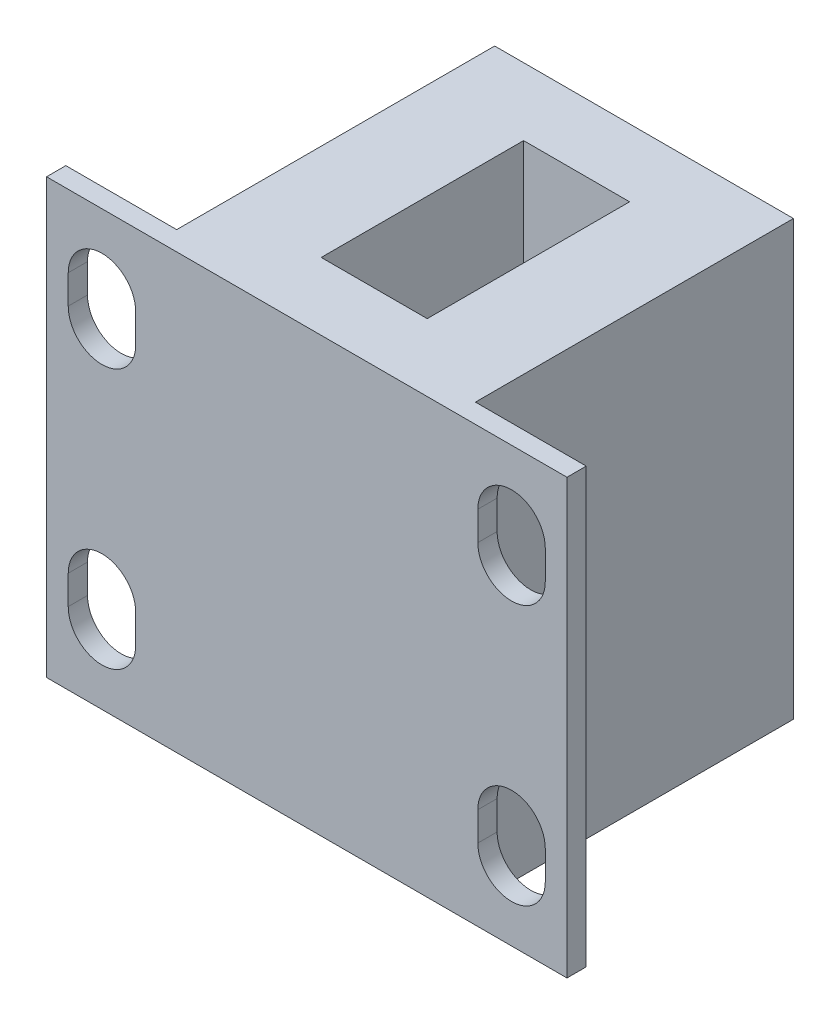
ISO-10303-21;
HEADER;
FILE_DESCRIPTION(('STEP AP214'),'2;1');
FILE_NAME('part.step','',(''),(''),'','','');
FILE_SCHEMA(('AUTOMOTIVE_DESIGN { 1 0 10303 214 1 1 1 1 }'));
ENDSEC;
DATA;
#1=APPLICATION_CONTEXT('core data for automotive mechanical design processes');
#2=APPLICATION_PROTOCOL_DEFINITION('international standard','automotive_design',2000,#1);
#3=PRODUCT_CONTEXT('',#1,'mechanical');
#4=PRODUCT('Part','Part','',(#3));
#5=PRODUCT_RELATED_PRODUCT_CATEGORY('part','',(#4));
#6=PRODUCT_DEFINITION_FORMATION('','',#4);
#7=PRODUCT_DEFINITION_CONTEXT('part definition',#1,'design');
#8=PRODUCT_DEFINITION('design','',#6,#7);
#9=PRODUCT_DEFINITION_SHAPE('','',#8);
#10=(LENGTH_UNIT() NAMED_UNIT(*) SI_UNIT(.MILLI.,.METRE.));
#11=(NAMED_UNIT(*) PLANE_ANGLE_UNIT() SI_UNIT($,.RADIAN.));
#12=(NAMED_UNIT(*) SI_UNIT($,.STERADIAN.) SOLID_ANGLE_UNIT());
#13=UNCERTAINTY_MEASURE_WITH_UNIT(LENGTH_MEASURE(1.E-05),#10,'distance_accuracy_value','');
#14=(GEOMETRIC_REPRESENTATION_CONTEXT(3) GLOBAL_UNCERTAINTY_ASSIGNED_CONTEXT((#13)) GLOBAL_UNIT_ASSIGNED_CONTEXT((#10,
#11,#12)) REPRESENTATION_CONTEXT('',''));
#15=CARTESIAN_POINT('',(0.,0.,0.));
#16=DIRECTION('',(0.,0.,1.));
#17=DIRECTION('',(1.,0.,0.));
#18=AXIS2_PLACEMENT_3D('',#15,#16,#17);
#19=CARTESIAN_POINT('',(0.,22.5,8.75));
#20=DIRECTION('',(0.,0.,-1.));
#21=DIRECTION('',(-1.,0.,0.));
#22=AXIS2_PLACEMENT_3D('',#19,#20,#21);
#23=PLANE('',#22);
#24=DIRECTION('',(0.,-1.,0.));
#25=VECTOR('',#24,1.);
#26=CARTESIAN_POINT('',(12.375,3.75,8.75));
#27=LINE('',#26,#25);
#28=CARTESIAN_POINT('',(12.375,5.25,8.75));
#29=VERTEX_POINT('',#28);
#30=CARTESIAN_POINT('',(12.375,3.75,8.75));
#31=VERTEX_POINT('',#30);
#32=EDGE_CURVE('E288',#29,#31,#27,.T.);
#33=ORIENTED_EDGE('',*,*,#32,.T.);
#34=CARTESIAN_POINT('',(10.625,3.75,8.75));
#35=DIRECTION('',(0.,0.,-1.));
#36=DIRECTION('',(1.,0.,0.));
#37=AXIS2_PLACEMENT_3D('',#34,#35,#36);
#38=CIRCLE('',#37,1.75);
#39=CARTESIAN_POINT('',(8.875,3.75,8.75));
#40=VERTEX_POINT('',#39);
#41=EDGE_CURVE('E277',#31,#40,#38,.T.);
#42=ORIENTED_EDGE('',*,*,#41,.T.);
#43=DIRECTION('',(0.,1.,0.));
#44=VECTOR('',#43,1.);
#45=CARTESIAN_POINT('',(8.875,3.75,8.75));
#46=LINE('',#45,#44);
#47=CARTESIAN_POINT('',(8.875,5.25,8.75));
#48=VERTEX_POINT('',#47);
#49=EDGE_CURVE('E281',#40,#48,#46,.T.);
#50=ORIENTED_EDGE('',*,*,#49,.T.);
#51=CARTESIAN_POINT('',(10.625,5.25,8.75));
#52=DIRECTION('',(0.,0.,-1.));
#53=DIRECTION('',(1.,0.,0.));
#54=AXIS2_PLACEMENT_3D('',#51,#52,#53);
#55=CIRCLE('',#54,1.75);
#56=EDGE_CURVE('E65',#48,#29,#55,.T.);
#57=ORIENTED_EDGE('',*,*,#56,.T.);
#58=EDGE_LOOP('',(#33,#42,#50,#57));
#59=FACE_BOUND('',#58,.T.);
#60=CARTESIAN_POINT('',(10.625,18.75,8.75));
#61=DIRECTION('',(0.,0.,1.));
#62=DIRECTION('',(1.,0.,0.));
#63=AXIS2_PLACEMENT_3D('',#60,#61,#62);
#64=CIRCLE('',#63,1.75);
#65=CARTESIAN_POINT('',(12.375,18.75,8.75));
#66=VERTEX_POINT('',#65);
#67=CARTESIAN_POINT('',(8.875,18.75,8.75));
#68=VERTEX_POINT('',#67);
#69=EDGE_CURVE('E362',#66,#68,#64,.T.);
#70=ORIENTED_EDGE('',*,*,#69,.F.);
#71=DIRECTION('',(0.,1.,0.));
#72=VECTOR('',#71,1.);
#73=CARTESIAN_POINT('',(12.375,18.75,8.75));
#74=LINE('',#73,#72);
#75=CARTESIAN_POINT('',(12.375,17.25,8.75));
#76=VERTEX_POINT('',#75);
#77=EDGE_CURVE('E365',#76,#66,#74,.T.);
#78=ORIENTED_EDGE('',*,*,#77,.F.);
#79=CARTESIAN_POINT('',(10.625,17.25,8.75));
#80=DIRECTION('',(0.,0.,1.));
#81=DIRECTION('',(1.,0.,0.));
#82=AXIS2_PLACEMENT_3D('',#79,#80,#81);
#83=CIRCLE('',#82,1.75);
#84=CARTESIAN_POINT('',(8.875,17.25,8.75));
#85=VERTEX_POINT('',#84);
#86=EDGE_CURVE('E369',#85,#76,#83,.T.);
#87=ORIENTED_EDGE('',*,*,#86,.F.);
#88=DIRECTION('',(0.,-1.,0.));
#89=VECTOR('',#88,1.);
#90=CARTESIAN_POINT('',(8.875,18.75,8.75));
#91=LINE('',#90,#89);
#92=EDGE_CURVE('E373',#68,#85,#91,.T.);
#93=ORIENTED_EDGE('',*,*,#92,.F.);
#94=EDGE_LOOP('',(#70,#78,#87,#93));
#95=FACE_BOUND('',#94,.T.);
#96=DIRECTION('',(0.,1.,0.));
#97=VECTOR('',#96,1.);
#98=CARTESIAN_POINT('',(-12.375,18.75,8.75));
#99=LINE('',#98,#97);
#100=CARTESIAN_POINT('',(-12.375,17.25,8.75));
#101=VERTEX_POINT('',#100);
#102=CARTESIAN_POINT('',(-12.375,18.75,8.75));
#103=VERTEX_POINT('',#102);
#104=EDGE_CURVE('E418',#101,#103,#99,.T.);
#105=ORIENTED_EDGE('',*,*,#104,.T.);
#106=CARTESIAN_POINT('',(-10.625,18.75,8.75));
#107=DIRECTION('',(0.,0.,-1.));
#108=DIRECTION('',(-1.,0.,0.));
#109=AXIS2_PLACEMENT_3D('',#106,#107,#108);
#110=CIRCLE('',#109,1.75);
#111=CARTESIAN_POINT('',(-8.875,18.75,8.75));
#112=VERTEX_POINT('',#111);
#113=EDGE_CURVE('E405',#103,#112,#110,.T.);
#114=ORIENTED_EDGE('',*,*,#113,.T.);
#115=DIRECTION('',(0.,-1.,0.));
#116=VECTOR('',#115,1.);
#117=CARTESIAN_POINT('',(-8.875,18.75,8.75));
#118=LINE('',#117,#116);
#119=CARTESIAN_POINT('',(-8.875,17.25,8.75));
#120=VERTEX_POINT('',#119);
#121=EDGE_CURVE('E409',#112,#120,#118,.T.);
#122=ORIENTED_EDGE('',*,*,#121,.T.);
#123=CARTESIAN_POINT('',(-10.625,17.25,8.75));
#124=DIRECTION('',(0.,0.,-1.));
#125=DIRECTION('',(-1.,0.,0.));
#126=AXIS2_PLACEMENT_3D('',#123,#124,#125);
#127=CIRCLE('',#126,1.75);
#128=EDGE_CURVE('E414',#120,#101,#127,.T.);
#129=ORIENTED_EDGE('',*,*,#128,.T.);
#130=EDGE_LOOP('',(#105,#114,#122,#129));
#131=FACE_BOUND('',#130,.T.);
#132=DIRECTION('',(1.,0.,0.));
#133=VECTOR('',#132,1.);
#134=CARTESIAN_POINT('',(0.,0.,8.75));
#135=LINE('',#134,#133);
#136=CARTESIAN_POINT('',(-13.5,0.,8.75));
#137=VERTEX_POINT('',#136);
#138=CARTESIAN_POINT('',(13.5,0.,8.75));
#139=VERTEX_POINT('',#138);
#140=EDGE_CURVE('E500',#137,#139,#135,.T.);
#141=ORIENTED_EDGE('',*,*,#140,.T.);
#142=DIRECTION('',(0.,-1.,0.));
#143=VECTOR('',#142,1.);
#144=CARTESIAN_POINT('',(13.5,22.5,8.75));
#145=LINE('',#144,#143);
#146=CARTESIAN_POINT('',(13.5,22.5,8.75));
#147=VERTEX_POINT('',#146);
#148=EDGE_CURVE('E516',#147,#139,#145,.T.);
#149=ORIENTED_EDGE('',*,*,#148,.F.);
#150=DIRECTION('',(1.,0.,0.));
#151=VECTOR('',#150,1.);
#152=CARTESIAN_POINT('',(0.,22.5,8.75));
#153=LINE('',#152,#151);
#154=CARTESIAN_POINT('',(-13.5,22.5,8.75));
#155=VERTEX_POINT('',#154);
#156=EDGE_CURVE('E469',#155,#147,#153,.T.);
#157=ORIENTED_EDGE('',*,*,#156,.F.);
#158=DIRECTION('',(0.,-1.,0.));
#159=VECTOR('',#158,1.);
#160=CARTESIAN_POINT('',(-13.5,22.5,8.75));
#161=LINE('',#160,#159);
#162=EDGE_CURVE('E519',#155,#137,#161,.T.);
#163=ORIENTED_EDGE('',*,*,#162,.T.);
#164=EDGE_LOOP('',(#141,#149,#157,#163));
#165=FACE_BOUND('',#164,.T.);
#166=CARTESIAN_POINT('',(-10.625,3.75,8.75));
#167=DIRECTION('',(0.,0.,1.));
#168=DIRECTION('',(-1.,0.,0.));
#169=AXIS2_PLACEMENT_3D('',#166,#167,#168);
#170=CIRCLE('',#169,1.75);
#171=CARTESIAN_POINT('',(-12.375,3.75,8.75));
#172=VERTEX_POINT('',#171);
#173=CARTESIAN_POINT('',(-8.875,3.75,8.75));
#174=VERTEX_POINT('',#173);
#175=EDGE_CURVE('E319',#172,#174,#170,.T.);
#176=ORIENTED_EDGE('',*,*,#175,.F.);
#177=DIRECTION('',(0.,-1.,0.));
#178=VECTOR('',#177,1.);
#179=CARTESIAN_POINT('',(-12.375,3.75,8.75));
#180=LINE('',#179,#178);
#181=CARTESIAN_POINT('',(-12.375,5.25,8.75000000000001));
#182=VERTEX_POINT('',#181);
#183=EDGE_CURVE('E322',#182,#172,#180,.T.);
#184=ORIENTED_EDGE('',*,*,#183,.F.);
#185=CARTESIAN_POINT('',(-10.625,5.25,8.75));
#186=DIRECTION('',(0.,0.,1.));
#187=DIRECTION('',(-1.,0.,0.));
#188=AXIS2_PLACEMENT_3D('',#185,#186,#187);
#189=CIRCLE('',#188,1.75);
#190=CARTESIAN_POINT('',(-8.875,5.25,8.75));
#191=VERTEX_POINT('',#190);
#192=EDGE_CURVE('E326',#191,#182,#189,.T.);
#193=ORIENTED_EDGE('',*,*,#192,.F.);
#194=DIRECTION('',(0.,1.,0.));
#195=VECTOR('',#194,1.);
#196=CARTESIAN_POINT('',(-8.875,3.75,8.75));
#197=LINE('',#196,#195);
#198=EDGE_CURVE('E330',#174,#191,#197,.T.);
#199=ORIENTED_EDGE('',*,*,#198,.F.);
#200=EDGE_LOOP('',(#176,#184,#193,#199));
#201=FACE_BOUND('',#200,.T.);
#202=ADVANCED_FACE('F41',(#59,#95,#131,#165,#201),#23,.F.);
#203=CARTESIAN_POINT('',(0.,22.5,7.75));
#204=DIRECTION('',(0.,0.,-1.));
#205=DIRECTION('',(-1.,0.,0.));
#206=AXIS2_PLACEMENT_3D('',#203,#204,#205);
#207=PLANE('',#206);
#208=CARTESIAN_POINT('',(-10.625,18.75,7.75));
#209=DIRECTION('',(0.,0.,-1.));
#210=DIRECTION('',(-1.,0.,0.));
#211=AXIS2_PLACEMENT_3D('',#208,#209,#210);
#212=CIRCLE('',#211,1.75);
#213=CARTESIAN_POINT('',(-12.375,18.75,7.75));
#214=VERTEX_POINT('',#213);
#215=CARTESIAN_POINT('',(-8.875,18.75,7.75));
#216=VERTEX_POINT('',#215);
#217=EDGE_CURVE('E395',#214,#216,#212,.T.);
#218=ORIENTED_EDGE('',*,*,#217,.F.);
#219=DIRECTION('',(0.,1.,0.));
#220=VECTOR('',#219,1.);
#221=CARTESIAN_POINT('',(-12.375,18.75,7.75));
#222=LINE('',#221,#220);
#223=CARTESIAN_POINT('',(-12.375,17.25,7.75));
#224=VERTEX_POINT('',#223);
#225=EDGE_CURVE('E410',#224,#214,#222,.T.);
#226=ORIENTED_EDGE('',*,*,#225,.F.);
#227=CARTESIAN_POINT('',(-10.625,17.25,7.75));
#228=DIRECTION('',(0.,0.,-1.));
#229=DIRECTION('',(-1.,0.,0.));
#230=AXIS2_PLACEMENT_3D('',#227,#228,#229);
#231=CIRCLE('',#230,1.75);
#232=CARTESIAN_POINT('',(-8.875,17.25,7.75));
#233=VERTEX_POINT('',#232);
#234=EDGE_CURVE('E429',#233,#224,#231,.T.);
#235=ORIENTED_EDGE('',*,*,#234,.F.);
#236=DIRECTION('',(0.,-1.,0.));
#237=VECTOR('',#236,1.);
#238=CARTESIAN_POINT('',(-8.875,18.75,7.75));
#239=LINE('',#238,#237);
#240=EDGE_CURVE('E425',#216,#233,#239,.T.);
#241=ORIENTED_EDGE('',*,*,#240,.F.);
#242=EDGE_LOOP('',(#218,#226,#235,#241));
#243=FACE_BOUND('',#242,.T.);
#244=DIRECTION('',(1.,0.,0.));
#245=VECTOR('',#244,1.);
#246=CARTESIAN_POINT('',(0.,0.,7.75));
#247=LINE('',#246,#245);
#248=CARTESIAN_POINT('',(-13.5,0.,7.75));
#249=VERTEX_POINT('',#248);
#250=CARTESIAN_POINT('',(-7.75,0.,7.75));
#251=VERTEX_POINT('',#250);
#252=EDGE_CURVE('E492',#249,#251,#247,.T.);
#253=ORIENTED_EDGE('',*,*,#252,.F.);
#254=DIRECTION('',(0.,-1.,0.));
#255=VECTOR('',#254,1.);
#256=CARTESIAN_POINT('',(-13.5,22.5,7.75));
#257=LINE('',#256,#255);
#258=CARTESIAN_POINT('',(-13.5,22.5,7.75));
#259=VERTEX_POINT('',#258);
#260=EDGE_CURVE('E522',#259,#249,#257,.T.);
#261=ORIENTED_EDGE('',*,*,#260,.F.);
#262=DIRECTION('',(1.,0.,0.));
#263=VECTOR('',#262,1.);
#264=CARTESIAN_POINT('',(0.,22.5,7.75));
#265=LINE('',#264,#263);
#266=CARTESIAN_POINT('',(-7.75,22.5,7.75));
#267=VERTEX_POINT('',#266);
#268=EDGE_CURVE('E461',#259,#267,#265,.T.);
#269=ORIENTED_EDGE('',*,*,#268,.T.);
#270=DIRECTION('',(0.,-1.,0.));
#271=VECTOR('',#270,1.);
#272=CARTESIAN_POINT('',(-7.75,22.5,7.75));
#273=LINE('',#272,#271);
#274=EDGE_CURVE('E525',#267,#251,#273,.T.);
#275=ORIENTED_EDGE('',*,*,#274,.T.);
#276=EDGE_LOOP('',(#253,#261,#269,#275));
#277=FACE_BOUND('',#276,.T.);
#278=DIRECTION('',(0.,-1.,0.));
#279=VECTOR('',#278,1.);
#280=CARTESIAN_POINT('',(-12.375,3.75,7.75));
#281=LINE('',#280,#279);
#282=CARTESIAN_POINT('',(-12.375,5.25,7.75));
#283=VERTEX_POINT('',#282);
#284=CARTESIAN_POINT('',(-12.375,3.75,7.75));
#285=VERTEX_POINT('',#284);
#286=EDGE_CURVE('E337',#283,#285,#281,.T.);
#287=ORIENTED_EDGE('',*,*,#286,.T.);
#288=CARTESIAN_POINT('',(-10.625,3.75,7.75));
#289=DIRECTION('',(0.,0.,1.));
#290=DIRECTION('',(-1.,0.,0.));
#291=AXIS2_PLACEMENT_3D('',#288,#289,#290);
#292=CIRCLE('',#291,1.75);
#293=CARTESIAN_POINT('',(-8.875,3.75,7.75));
#294=VERTEX_POINT('',#293);
#295=EDGE_CURVE('E309',#285,#294,#292,.T.);
#296=ORIENTED_EDGE('',*,*,#295,.T.);
#297=DIRECTION('',(0.,1.,0.));
#298=VECTOR('',#297,1.);
#299=CARTESIAN_POINT('',(-8.875,3.75,7.75));
#300=LINE('',#299,#298);
#301=CARTESIAN_POINT('',(-8.875,5.25,7.75));
#302=VERTEX_POINT('',#301);
#303=EDGE_CURVE('E323',#294,#302,#300,.T.);
#304=ORIENTED_EDGE('',*,*,#303,.T.);
#305=CARTESIAN_POINT('',(-10.625,5.25,7.75));
#306=DIRECTION('',(0.,0.,1.));
#307=DIRECTION('',(-1.,0.,0.));
#308=AXIS2_PLACEMENT_3D('',#305,#306,#307);
#309=CIRCLE('',#308,1.75);
#310=EDGE_CURVE('E341',#302,#283,#309,.T.);
#311=ORIENTED_EDGE('',*,*,#310,.T.);
#312=EDGE_LOOP('',(#287,#296,#304,#311));
#313=FACE_BOUND('',#312,.T.);
#314=ADVANCED_FACE('F562',(#243,#277,#313),#207,.T.);
#315=CARTESIAN_POINT('',(0.,22.5,7.75));
#316=DIRECTION('',(0.,0.,-1.));
#317=DIRECTION('',(-1.,0.,0.));
#318=AXIS2_PLACEMENT_3D('',#315,#316,#317);
#319=PLANE('',#318);
#320=CARTESIAN_POINT('',(10.625,3.75,7.75));
#321=DIRECTION('',(0.,0.,-1.));
#322=DIRECTION('',(1.,0.,0.));
#323=AXIS2_PLACEMENT_3D('',#320,#321,#322);
#324=CIRCLE('',#323,1.75);
#325=CARTESIAN_POINT('',(12.375,3.75,7.75));
#326=VERTEX_POINT('',#325);
#327=CARTESIAN_POINT('',(8.875,3.75,7.75));
#328=VERTEX_POINT('',#327);
#329=EDGE_CURVE('E271',#326,#328,#324,.T.);
#330=ORIENTED_EDGE('',*,*,#329,.F.);
#331=DIRECTION('',(0.,-1.,0.));
#332=VECTOR('',#331,1.);
#333=CARTESIAN_POINT('',(12.375,3.75,7.75));
#334=LINE('',#333,#332);
#335=CARTESIAN_POINT('',(12.375,5.25,7.75));
#336=VERTEX_POINT('',#335);
#337=EDGE_CURVE('E282',#336,#326,#334,.T.);
#338=ORIENTED_EDGE('',*,*,#337,.F.);
#339=CARTESIAN_POINT('',(10.625,5.25,7.75));
#340=DIRECTION('',(0.,0.,-1.));
#341=DIRECTION('',(1.,0.,0.));
#342=AXIS2_PLACEMENT_3D('',#339,#340,#341);
#343=CIRCLE('',#342,1.75);
#344=CARTESIAN_POINT('',(8.875,5.25,7.75));
#345=VERTEX_POINT('',#344);
#346=EDGE_CURVE('E299',#345,#336,#343,.T.);
#347=ORIENTED_EDGE('',*,*,#346,.F.);
#348=DIRECTION('',(0.,1.,0.));
#349=VECTOR('',#348,1.);
#350=CARTESIAN_POINT('',(8.875,3.75,7.75));
#351=LINE('',#350,#349);
#352=EDGE_CURVE('E295',#328,#345,#351,.T.);
#353=ORIENTED_EDGE('',*,*,#352,.F.);
#354=EDGE_LOOP('',(#330,#338,#347,#353));
#355=FACE_BOUND('',#354,.T.);
#356=DIRECTION('',(1.,0.,0.));
#357=VECTOR('',#356,1.);
#358=CARTESIAN_POINT('',(0.,0.,7.75));
#359=LINE('',#358,#357);
#360=CARTESIAN_POINT('',(7.75,0.,7.75));
#361=VERTEX_POINT('',#360);
#362=CARTESIAN_POINT('',(13.5,0.,7.75));
#363=VERTEX_POINT('',#362);
#364=EDGE_CURVE('E454',#361,#363,#359,.T.);
#365=ORIENTED_EDGE('',*,*,#364,.F.);
#366=DIRECTION('',(0.,-1.,0.));
#367=VECTOR('',#366,1.);
#368=CARTESIAN_POINT('',(7.75,22.5,7.75));
#369=LINE('',#368,#367);
#370=CARTESIAN_POINT('',(7.75,22.5,7.75));
#371=VERTEX_POINT('',#370);
#372=EDGE_CURVE('E480',#371,#361,#369,.T.);
#373=ORIENTED_EDGE('',*,*,#372,.F.);
#374=DIRECTION('',(1.,0.,0.));
#375=VECTOR('',#374,1.);
#376=CARTESIAN_POINT('',(0.,22.5,7.75));
#377=LINE('',#376,#375);
#378=CARTESIAN_POINT('',(13.5,22.5,7.75));
#379=VERTEX_POINT('',#378);
#380=EDGE_CURVE('E476',#371,#379,#377,.T.);
#381=ORIENTED_EDGE('',*,*,#380,.T.);
#382=DIRECTION('',(0.,-1.,0.));
#383=VECTOR('',#382,1.);
#384=CARTESIAN_POINT('',(13.5,22.5,7.75));
#385=LINE('',#384,#383);
#386=EDGE_CURVE('E513',#379,#363,#385,.T.);
#387=ORIENTED_EDGE('',*,*,#386,.T.);
#388=EDGE_LOOP('',(#365,#373,#381,#387));
#389=FACE_BOUND('',#388,.T.);
#390=DIRECTION('',(0.,1.,0.));
#391=VECTOR('',#390,1.);
#392=CARTESIAN_POINT('',(12.375,18.75,7.75));
#393=LINE('',#392,#391);
#394=CARTESIAN_POINT('',(12.375,17.25,7.75));
#395=VERTEX_POINT('',#394);
#396=CARTESIAN_POINT('',(12.375,18.75,7.75));
#397=VERTEX_POINT('',#396);
#398=EDGE_CURVE('E380',#395,#397,#393,.T.);
#399=ORIENTED_EDGE('',*,*,#398,.T.);
#400=CARTESIAN_POINT('',(10.625,18.75,7.75));
#401=DIRECTION('',(0.,0.,1.));
#402=DIRECTION('',(1.,0.,0.));
#403=AXIS2_PLACEMENT_3D('',#400,#401,#402);
#404=CIRCLE('',#403,1.75);
#405=CARTESIAN_POINT('',(8.875,18.75,7.75));
#406=VERTEX_POINT('',#405);
#407=EDGE_CURVE('E352',#397,#406,#404,.T.);
#408=ORIENTED_EDGE('',*,*,#407,.T.);
#409=DIRECTION('',(0.,-1.,0.));
#410=VECTOR('',#409,1.);
#411=CARTESIAN_POINT('',(8.875,18.75,7.75));
#412=LINE('',#411,#410);
#413=CARTESIAN_POINT('',(8.875,17.25,7.75));
#414=VERTEX_POINT('',#413);
#415=EDGE_CURVE('E366',#406,#414,#412,.T.);
#416=ORIENTED_EDGE('',*,*,#415,.T.);
#417=CARTESIAN_POINT('',(10.625,17.25,7.75));
#418=DIRECTION('',(0.,0.,1.));
#419=DIRECTION('',(1.,0.,0.));
#420=AXIS2_PLACEMENT_3D('',#417,#418,#419);
#421=CIRCLE('',#420,1.75);
#422=EDGE_CURVE('E384',#414,#395,#421,.T.);
#423=ORIENTED_EDGE('',*,*,#422,.T.);
#424=EDGE_LOOP('',(#399,#408,#416,#423));
#425=FACE_BOUND('',#424,.T.);
#426=ADVANCED_FACE('F545',(#355,#389,#425),#319,.T.);
#427=CARTESIAN_POINT('',(7.75,22.5,0.));
#428=DIRECTION('',(1.,0.,0.));
#429=DIRECTION('',(0.,0.,-1.));
#430=AXIS2_PLACEMENT_3D('',#427,#428,#429);
#431=PLANE('',#430);
#432=DIRECTION('',(0.,0.,1.));
#433=VECTOR('',#432,1.);
#434=CARTESIAN_POINT('',(7.75,0.,0.));
#435=LINE('',#434,#433);
#436=CARTESIAN_POINT('',(7.75,0.,-8.75));
#437=VERTEX_POINT('',#436);
#438=EDGE_CURVE('E439',#437,#361,#435,.T.);
#439=ORIENTED_EDGE('',*,*,#438,.F.);
#440=DIRECTION('',(0.,-1.,0.));
#441=VECTOR('',#440,1.);
#442=CARTESIAN_POINT('',(7.75,22.5,-8.75));
#443=LINE('',#442,#441);
#444=CARTESIAN_POINT('',(7.75,22.5,-8.75));
#445=VERTEX_POINT('',#444);
#446=EDGE_CURVE('E11',#445,#437,#443,.T.);
#447=ORIENTED_EDGE('',*,*,#446,.F.);
#448=DIRECTION('',(0.,0.,1.));
#449=VECTOR('',#448,1.);
#450=CARTESIAN_POINT('',(7.75,22.5,0.));
#451=LINE('',#450,#449);
#452=EDGE_CURVE('E449',#445,#371,#451,.T.);
#453=ORIENTED_EDGE('',*,*,#452,.T.);
#454=ORIENTED_EDGE('',*,*,#372,.T.);
#455=EDGE_LOOP('',(#439,#447,#453,#454));
#456=FACE_BOUND('',#455,.T.);
#457=ADVANCED_FACE('F43',(#456),#431,.T.);
#458=CARTESIAN_POINT('',(0.,22.5,-8.75));
#459=DIRECTION('',(0.,0.,-1.));
#460=DIRECTION('',(-1.,0.,0.));
#461=AXIS2_PLACEMENT_3D('',#458,#459,#460);
#462=PLANE('',#461);
#463=DIRECTION('',(1.,0.,0.));
#464=VECTOR('',#463,1.);
#465=CARTESIAN_POINT('',(0.,0.,-8.75));
#466=LINE('',#465,#464);
#467=CARTESIAN_POINT('',(-7.75,0.,-8.75));
#468=VERTEX_POINT('',#467);
#469=EDGE_CURVE('E484',#468,#437,#466,.T.);
#470=ORIENTED_EDGE('',*,*,#469,.F.);
#471=DIRECTION('',(0.,-1.,0.));
#472=VECTOR('',#471,1.);
#473=CARTESIAN_POINT('',(-7.75,22.5,-8.75));
#474=LINE('',#473,#472);
#475=CARTESIAN_POINT('',(-7.75,22.5,-8.75));
#476=VERTEX_POINT('',#475);
#477=EDGE_CURVE('E50',#476,#468,#474,.T.);
#478=ORIENTED_EDGE('',*,*,#477,.F.);
#479=DIRECTION('',(1.,0.,0.));
#480=VECTOR('',#479,1.);
#481=CARTESIAN_POINT('',(0.,22.5,-8.75));
#482=LINE('',#481,#480);
#483=EDGE_CURVE('E453',#476,#445,#482,.T.);
#484=ORIENTED_EDGE('',*,*,#483,.T.);
#485=ORIENTED_EDGE('',*,*,#446,.T.);
#486=EDGE_LOOP('',(#470,#478,#484,#485));
#487=FACE_BOUND('',#486,.T.);
#488=ADVANCED_FACE('F539',(#487),#462,.T.);
#489=CARTESIAN_POINT('',(-7.75,22.5,0.));
#490=DIRECTION('',(1.,0.,0.));
#491=DIRECTION('',(0.,0.,-1.));
#492=AXIS2_PLACEMENT_3D('',#489,#490,#491);
#493=PLANE('',#492);
#494=DIRECTION('',(0.,0.,1.));
#495=VECTOR('',#494,1.);
#496=CARTESIAN_POINT('',(-7.75,0.,0.));
#497=LINE('',#496,#495);
#498=EDGE_CURVE('E488',#468,#251,#497,.T.);
#499=ORIENTED_EDGE('',*,*,#498,.T.);
#500=ORIENTED_EDGE('',*,*,#274,.F.);
#501=DIRECTION('',(0.,0.,1.));
#502=VECTOR('',#501,1.);
#503=CARTESIAN_POINT('',(-7.75,22.5,0.));
#504=LINE('',#503,#502);
#505=EDGE_CURVE('E458',#476,#267,#504,.T.);
#506=ORIENTED_EDGE('',*,*,#505,.F.);
#507=ORIENTED_EDGE('',*,*,#477,.T.);
#508=EDGE_LOOP('',(#499,#500,#506,#507));
#509=FACE_BOUND('',#508,.T.);
#510=ADVANCED_FACE('F531',(#509),#493,.F.);
#511=CARTESIAN_POINT('',(-13.5,22.5,0.));
#512=DIRECTION('',(-1.,0.,0.));
#513=DIRECTION('',(0.,0.,1.));
#514=AXIS2_PLACEMENT_3D('',#511,#512,#513);
#515=PLANE('',#514);
#516=DIRECTION('',(0.,0.,-1.));
#517=VECTOR('',#516,1.);
#518=CARTESIAN_POINT('',(-13.5,0.,0.));
#519=LINE('',#518,#517);
#520=EDGE_CURVE('E496',#137,#249,#519,.T.);
#521=ORIENTED_EDGE('',*,*,#520,.F.);
#522=ORIENTED_EDGE('',*,*,#162,.F.);
#523=DIRECTION('',(0.,0.,-1.));
#524=VECTOR('',#523,1.);
#525=CARTESIAN_POINT('',(-13.5,22.5,0.));
#526=LINE('',#525,#524);
#527=EDGE_CURVE('E465',#155,#259,#526,.T.);
#528=ORIENTED_EDGE('',*,*,#527,.T.);
#529=ORIENTED_EDGE('',*,*,#260,.T.);
#530=EDGE_LOOP('',(#521,#522,#528,#529));
#531=FACE_BOUND('',#530,.T.);
#532=ADVANCED_FACE('F557',(#531),#515,.T.);
#533=CARTESIAN_POINT('',(13.5,22.5,0.));
#534=DIRECTION('',(1.,0.,0.));
#535=DIRECTION('',(0.,0.,-1.));
#536=AXIS2_PLACEMENT_3D('',#533,#534,#535);
#537=PLANE('',#536);
#538=DIRECTION('',(0.,0.,1.));
#539=VECTOR('',#538,1.);
#540=CARTESIAN_POINT('',(13.5,0.,0.));
#541=LINE('',#540,#539);
#542=EDGE_CURVE('E504',#363,#139,#541,.T.);
#543=ORIENTED_EDGE('',*,*,#542,.F.);
#544=ORIENTED_EDGE('',*,*,#386,.F.);
#545=DIRECTION('',(0.,0.,1.));
#546=VECTOR('',#545,1.);
#547=CARTESIAN_POINT('',(13.5,22.5,0.));
#548=LINE('',#547,#546);
#549=EDGE_CURVE('E472',#379,#147,#548,.T.);
#550=ORIENTED_EDGE('',*,*,#549,.T.);
#551=ORIENTED_EDGE('',*,*,#148,.T.);
#552=EDGE_LOOP('',(#543,#544,#550,#551));
#553=FACE_BOUND('',#552,.T.);
#554=ADVANCED_FACE('F551',(#553),#537,.T.);
#555=CARTESIAN_POINT('',(0.,22.5,0.));
#556=DIRECTION('',(0.,1.,0.));
#557=DIRECTION('',(0.,0.,1.));
#558=AXIS2_PLACEMENT_3D('',#555,#556,#557);
#559=PLANE('',#558);
#560=DIRECTION('',(0.,0.,1.));
#561=VECTOR('',#560,1.);
#562=CARTESIAN_POINT('',(-2.75,22.5,5.25));
#563=LINE('',#562,#561);
#564=CARTESIAN_POINT('',(-2.75,22.5,-5.25));
#565=VERTEX_POINT('',#564);
#566=CARTESIAN_POINT('',(-2.75,22.5,5.25));
#567=VERTEX_POINT('',#566);
#568=EDGE_CURVE('E57',#565,#567,#563,.T.);
#569=ORIENTED_EDGE('',*,*,#568,.F.);
#570=DIRECTION('',(-1.,0.,0.));
#571=VECTOR('',#570,1.);
#572=CARTESIAN_POINT('',(2.75,22.5,-5.25));
#573=LINE('',#572,#571);
#574=CARTESIAN_POINT('',(2.75,22.5,-5.25));
#575=VERTEX_POINT('',#574);
#576=EDGE_CURVE('E249',#575,#565,#573,.T.);
#577=ORIENTED_EDGE('',*,*,#576,.F.);
#578=DIRECTION('',(0.,0.,-1.));
#579=VECTOR('',#578,1.);
#580=CARTESIAN_POINT('',(2.75,22.5,5.25));
#581=LINE('',#580,#579);
#582=CARTESIAN_POINT('',(2.75,22.5,5.25));
#583=VERTEX_POINT('',#582);
#584=EDGE_CURVE('E253',#583,#575,#581,.T.);
#585=ORIENTED_EDGE('',*,*,#584,.F.);
#586=DIRECTION('',(1.,0.,0.));
#587=VECTOR('',#586,1.);
#588=CARTESIAN_POINT('',(2.75,22.5,5.25));
#589=LINE('',#588,#587);
#590=EDGE_CURVE('E262',#567,#583,#589,.T.);
#591=ORIENTED_EDGE('',*,*,#590,.F.);
#592=EDGE_LOOP('',(#569,#577,#585,#591));
#593=FACE_BOUND('',#592,.T.);
#594=ORIENTED_EDGE('',*,*,#452,.F.);
#595=ORIENTED_EDGE('',*,*,#483,.F.);
#596=ORIENTED_EDGE('',*,*,#505,.T.);
#597=ORIENTED_EDGE('',*,*,#268,.F.);
#598=ORIENTED_EDGE('',*,*,#527,.F.);
#599=ORIENTED_EDGE('',*,*,#156,.T.);
#600=ORIENTED_EDGE('',*,*,#549,.F.);
#601=ORIENTED_EDGE('',*,*,#380,.F.);
#602=EDGE_LOOP('',(#594,#595,#596,#597,#598,#599,#600,#601));
#603=FACE_BOUND('',#602,.T.);
#604=ADVANCED_FACE('F565',(#593,#603),#559,.T.);
#605=CARTESIAN_POINT('',(0.,0.,0.));
#606=DIRECTION('',(0.,1.,0.));
#607=DIRECTION('',(0.,0.,1.));
#608=AXIS2_PLACEMENT_3D('',#605,#606,#607);
#609=PLANE('',#608);
#610=ORIENTED_EDGE('',*,*,#438,.T.);
#611=ORIENTED_EDGE('',*,*,#364,.T.);
#612=ORIENTED_EDGE('',*,*,#542,.T.);
#613=ORIENTED_EDGE('',*,*,#140,.F.);
#614=ORIENTED_EDGE('',*,*,#520,.T.);
#615=ORIENTED_EDGE('',*,*,#252,.T.);
#616=ORIENTED_EDGE('',*,*,#498,.F.);
#617=ORIENTED_EDGE('',*,*,#469,.T.);
#618=EDGE_LOOP('',(#610,#611,#612,#613,#614,#615,#616,#617));
#619=FACE_BOUND('',#618,.T.);
#620=ADVANCED_FACE('F537',(#619),#609,.F.);
#621=CARTESIAN_POINT('',(-10.625,18.75,8.75));
#622=DIRECTION('',(0.,0.,-1.));
#623=DIRECTION('',(-1.,0.,0.));
#624=AXIS2_PLACEMENT_3D('',#621,#622,#623);
#625=CYLINDRICAL_SURFACE('',#624,1.75);
#626=ORIENTED_EDGE('',*,*,#217,.T.);
#627=DIRECTION('',(0.,0.,-1.));
#628=VECTOR('',#627,1.);
#629=CARTESIAN_POINT('',(-8.875,18.75,8.75));
#630=LINE('',#629,#628);
#631=EDGE_CURVE('E422',#112,#216,#630,.T.);
#632=ORIENTED_EDGE('',*,*,#631,.F.);
#633=ORIENTED_EDGE('',*,*,#113,.F.);
#634=DIRECTION('',(0.,0.,-1.));
#635=VECTOR('',#634,1.);
#636=CARTESIAN_POINT('',(-12.375,18.75,8.75));
#637=LINE('',#636,#635);
#638=EDGE_CURVE('E436',#103,#214,#637,.T.);
#639=ORIENTED_EDGE('',*,*,#638,.T.);
#640=EDGE_LOOP('',(#626,#632,#633,#639));
#641=FACE_BOUND('',#640,.T.);
#642=ADVANCED_FACE('F621',(#641),#625,.F.);
#643=CARTESIAN_POINT('',(-12.375,18.75,8.75));
#644=DIRECTION('',(-1.,0.,0.));
#645=DIRECTION('',(0.,0.,1.));
#646=AXIS2_PLACEMENT_3D('',#643,#644,#645);
#647=PLANE('',#646);
#648=ORIENTED_EDGE('',*,*,#225,.T.);
#649=ORIENTED_EDGE('',*,*,#638,.F.);
#650=ORIENTED_EDGE('',*,*,#104,.F.);
#651=DIRECTION('',(0.,0.,-1.));
#652=VECTOR('',#651,1.);
#653=CARTESIAN_POINT('',(-12.375,17.25,8.75));
#654=LINE('',#653,#652);
#655=EDGE_CURVE('E440',#101,#224,#654,.T.);
#656=ORIENTED_EDGE('',*,*,#655,.T.);
#657=EDGE_LOOP('',(#648,#649,#650,#656));
#658=FACE_BOUND('',#657,.T.);
#659=ADVANCED_FACE('F617',(#658),#647,.F.);
#660=CARTESIAN_POINT('',(-10.625,17.25,8.75));
#661=DIRECTION('',(0.,0.,-1.));
#662=DIRECTION('',(-1.,0.,0.));
#663=AXIS2_PLACEMENT_3D('',#660,#661,#662);
#664=CYLINDRICAL_SURFACE('',#663,1.75);
#665=ORIENTED_EDGE('',*,*,#234,.T.);
#666=ORIENTED_EDGE('',*,*,#655,.F.);
#667=ORIENTED_EDGE('',*,*,#128,.F.);
#668=DIRECTION('',(0.,0.,-1.));
#669=VECTOR('',#668,1.);
#670=CARTESIAN_POINT('',(-8.875,17.25,8.75));
#671=LINE('',#670,#669);
#672=EDGE_CURVE('E443',#120,#233,#671,.T.);
#673=ORIENTED_EDGE('',*,*,#672,.T.);
#674=EDGE_LOOP('',(#665,#666,#667,#673));
#675=FACE_BOUND('',#674,.T.);
#676=ADVANCED_FACE('F620',(#675),#664,.F.);
#677=CARTESIAN_POINT('',(-8.875,18.75,8.75));
#678=DIRECTION('',(1.,0.,0.));
#679=DIRECTION('',(0.,0.,-1.));
#680=AXIS2_PLACEMENT_3D('',#677,#678,#679);
#681=PLANE('',#680);
#682=ORIENTED_EDGE('',*,*,#240,.T.);
#683=ORIENTED_EDGE('',*,*,#672,.F.);
#684=ORIENTED_EDGE('',*,*,#121,.F.);
#685=ORIENTED_EDGE('',*,*,#631,.T.);
#686=EDGE_LOOP('',(#682,#683,#684,#685));
#687=FACE_BOUND('',#686,.T.);
#688=ADVANCED_FACE('F615',(#687),#681,.F.);
#689=CARTESIAN_POINT('',(10.625,18.75,8.75));
#690=DIRECTION('',(0.,0.,-1.));
#691=DIRECTION('',(-1.,0.,0.));
#692=AXIS2_PLACEMENT_3D('',#689,#690,#691);
#693=CYLINDRICAL_SURFACE('',#692,1.75);
#694=ORIENTED_EDGE('',*,*,#407,.F.);
#695=DIRECTION('',(0.,0.,-1.));
#696=VECTOR('',#695,1.);
#697=CARTESIAN_POINT('',(12.375,18.75,8.75));
#698=LINE('',#697,#696);
#699=EDGE_CURVE('E376',#66,#397,#698,.T.);
#700=ORIENTED_EDGE('',*,*,#699,.F.);
#701=ORIENTED_EDGE('',*,*,#69,.T.);
#702=DIRECTION('',(0.,0.,-1.));
#703=VECTOR('',#702,1.);
#704=CARTESIAN_POINT('',(8.875,18.75,8.75));
#705=LINE('',#704,#703);
#706=EDGE_CURVE('E391',#68,#406,#705,.T.);
#707=ORIENTED_EDGE('',*,*,#706,.T.);
#708=EDGE_LOOP('',(#694,#700,#701,#707));
#709=FACE_BOUND('',#708,.T.);
#710=ADVANCED_FACE('F605',(#709),#693,.F.);
#711=CARTESIAN_POINT('',(8.875,18.75,8.75));
#712=DIRECTION('',(1.,0.,0.));
#713=DIRECTION('',(0.,0.,-1.));
#714=AXIS2_PLACEMENT_3D('',#711,#712,#713);
#715=PLANE('',#714);
#716=ORIENTED_EDGE('',*,*,#415,.F.);
#717=ORIENTED_EDGE('',*,*,#706,.F.);
#718=ORIENTED_EDGE('',*,*,#92,.T.);
#719=DIRECTION('',(0.,0.,-1.));
#720=VECTOR('',#719,1.);
#721=CARTESIAN_POINT('',(8.875,17.25,8.75));
#722=LINE('',#721,#720);
#723=EDGE_CURVE('E396',#85,#414,#722,.T.);
#724=ORIENTED_EDGE('',*,*,#723,.T.);
#725=EDGE_LOOP('',(#716,#717,#718,#724));
#726=FACE_BOUND('',#725,.T.);
#727=ADVANCED_FACE('F601',(#726),#715,.T.);
#728=CARTESIAN_POINT('',(10.625,17.25,8.75));
#729=DIRECTION('',(0.,0.,-1.));
#730=DIRECTION('',(-1.,0.,0.));
#731=AXIS2_PLACEMENT_3D('',#728,#729,#730);
#732=CYLINDRICAL_SURFACE('',#731,1.75);
#733=ORIENTED_EDGE('',*,*,#422,.F.);
#734=ORIENTED_EDGE('',*,*,#723,.F.);
#735=ORIENTED_EDGE('',*,*,#86,.T.);
#736=DIRECTION('',(0.,0.,-1.));
#737=VECTOR('',#736,1.);
#738=CARTESIAN_POINT('',(12.375,17.25,8.75));
#739=LINE('',#738,#737);
#740=EDGE_CURVE('E399',#76,#395,#739,.T.);
#741=ORIENTED_EDGE('',*,*,#740,.T.);
#742=EDGE_LOOP('',(#733,#734,#735,#741));
#743=FACE_BOUND('',#742,.T.);
#744=ADVANCED_FACE('F604',(#743),#732,.F.);
#745=CARTESIAN_POINT('',(12.375,18.75,8.75));
#746=DIRECTION('',(-1.,0.,0.));
#747=DIRECTION('',(0.,0.,1.));
#748=AXIS2_PLACEMENT_3D('',#745,#746,#747);
#749=PLANE('',#748);
#750=ORIENTED_EDGE('',*,*,#398,.F.);
#751=ORIENTED_EDGE('',*,*,#740,.F.);
#752=ORIENTED_EDGE('',*,*,#77,.T.);
#753=ORIENTED_EDGE('',*,*,#699,.T.);
#754=EDGE_LOOP('',(#750,#751,#752,#753));
#755=FACE_BOUND('',#754,.T.);
#756=ADVANCED_FACE('F600',(#755),#749,.T.);
#757=CARTESIAN_POINT('',(-10.625,3.75,8.75));
#758=DIRECTION('',(0.,0.,-1.));
#759=DIRECTION('',(-1.,0.,0.));
#760=AXIS2_PLACEMENT_3D('',#757,#758,#759);
#761=CYLINDRICAL_SURFACE('',#760,1.75);
#762=ORIENTED_EDGE('',*,*,#295,.F.);
#763=DIRECTION('',(0.,0.,-1.));
#764=VECTOR('',#763,1.);
#765=CARTESIAN_POINT('',(-12.375,3.75,8.75));
#766=LINE('',#765,#764);
#767=EDGE_CURVE('E333',#172,#285,#766,.T.);
#768=ORIENTED_EDGE('',*,*,#767,.F.);
#769=ORIENTED_EDGE('',*,*,#175,.T.);
#770=DIRECTION('',(0.,0.,-1.));
#771=VECTOR('',#770,1.);
#772=CARTESIAN_POINT('',(-8.875,3.75,8.75));
#773=LINE('',#772,#771);
#774=EDGE_CURVE('E348',#174,#294,#773,.T.);
#775=ORIENTED_EDGE('',*,*,#774,.T.);
#776=EDGE_LOOP('',(#762,#768,#769,#775));
#777=FACE_BOUND('',#776,.T.);
#778=ADVANCED_FACE('F577',(#777),#761,.F.);
#779=CARTESIAN_POINT('',(-8.875,3.75,8.75));
#780=DIRECTION('',(-1.,0.,0.));
#781=DIRECTION('',(0.,0.,1.));
#782=AXIS2_PLACEMENT_3D('',#779,#780,#781);
#783=PLANE('',#782);
#784=ORIENTED_EDGE('',*,*,#303,.F.);
#785=ORIENTED_EDGE('',*,*,#774,.F.);
#786=ORIENTED_EDGE('',*,*,#198,.T.);
#787=DIRECTION('',(0.,0.,-1.));
#788=VECTOR('',#787,1.);
#789=CARTESIAN_POINT('',(-8.875,5.25,8.75));
#790=LINE('',#789,#788);
#791=EDGE_CURVE('E353',#191,#302,#790,.T.);
#792=ORIENTED_EDGE('',*,*,#791,.T.);
#793=EDGE_LOOP('',(#784,#785,#786,#792));
#794=FACE_BOUND('',#793,.T.);
#795=ADVANCED_FACE('F579',(#794),#783,.T.);
#796=CARTESIAN_POINT('',(-10.625,5.25,8.75));
#797=DIRECTION('',(0.,0.,-1.));
#798=DIRECTION('',(-1.,0.,0.));
#799=AXIS2_PLACEMENT_3D('',#796,#797,#798);
#800=CYLINDRICAL_SURFACE('',#799,1.75);
#801=ORIENTED_EDGE('',*,*,#310,.F.);
#802=ORIENTED_EDGE('',*,*,#791,.F.);
#803=ORIENTED_EDGE('',*,*,#192,.T.);
#804=DIRECTION('',(0.,0.,-1.));
#805=VECTOR('',#804,1.);
#806=CARTESIAN_POINT('',(-12.375,5.25,8.75));
#807=LINE('',#806,#805);
#808=EDGE_CURVE('E356',#182,#283,#807,.T.);
#809=ORIENTED_EDGE('',*,*,#808,.T.);
#810=EDGE_LOOP('',(#801,#802,#803,#809));
#811=FACE_BOUND('',#810,.T.);
#812=ADVANCED_FACE('F586',(#811),#800,.F.);
#813=CARTESIAN_POINT('',(-12.375,3.75,8.75));
#814=DIRECTION('',(1.,0.,0.));
#815=DIRECTION('',(0.,0.,-1.));
#816=AXIS2_PLACEMENT_3D('',#813,#814,#815);
#817=PLANE('',#816);
#818=ORIENTED_EDGE('',*,*,#286,.F.);
#819=ORIENTED_EDGE('',*,*,#808,.F.);
#820=ORIENTED_EDGE('',*,*,#183,.T.);
#821=ORIENTED_EDGE('',*,*,#767,.T.);
#822=EDGE_LOOP('',(#818,#819,#820,#821));
#823=FACE_BOUND('',#822,.T.);
#824=ADVANCED_FACE('F584',(#823),#817,.T.);
#825=CARTESIAN_POINT('',(10.625,3.75,8.75));
#826=DIRECTION('',(0.,0.,-1.));
#827=DIRECTION('',(-1.,0.,0.));
#828=AXIS2_PLACEMENT_3D('',#825,#826,#827);
#829=CYLINDRICAL_SURFACE('',#828,1.75);
#830=ORIENTED_EDGE('',*,*,#329,.T.);
#831=DIRECTION('',(0.,0.,-1.));
#832=VECTOR('',#831,1.);
#833=CARTESIAN_POINT('',(8.875,3.75,8.75));
#834=LINE('',#833,#832);
#835=EDGE_CURVE('E292',#40,#328,#834,.T.);
#836=ORIENTED_EDGE('',*,*,#835,.F.);
#837=ORIENTED_EDGE('',*,*,#41,.F.);
#838=DIRECTION('',(0.,0.,-1.));
#839=VECTOR('',#838,1.);
#840=CARTESIAN_POINT('',(12.375,3.75,8.75));
#841=LINE('',#840,#839);
#842=EDGE_CURVE('E306',#31,#326,#841,.T.);
#843=ORIENTED_EDGE('',*,*,#842,.T.);
#844=EDGE_LOOP('',(#830,#836,#837,#843));
#845=FACE_BOUND('',#844,.T.);
#846=ADVANCED_FACE('F593',(#845),#829,.F.);
#847=CARTESIAN_POINT('',(12.375,3.75,8.75));
#848=DIRECTION('',(1.,0.,0.));
#849=DIRECTION('',(0.,0.,-1.));
#850=AXIS2_PLACEMENT_3D('',#847,#848,#849);
#851=PLANE('',#850);
#852=ORIENTED_EDGE('',*,*,#337,.T.);
#853=ORIENTED_EDGE('',*,*,#842,.F.);
#854=ORIENTED_EDGE('',*,*,#32,.F.);
#855=DIRECTION('',(0.,0.,-1.));
#856=VECTOR('',#855,1.);
#857=CARTESIAN_POINT('',(12.375,5.25,8.75));
#858=LINE('',#857,#856);
#859=EDGE_CURVE('E310',#29,#336,#858,.T.);
#860=ORIENTED_EDGE('',*,*,#859,.T.);
#861=EDGE_LOOP('',(#852,#853,#854,#860));
#862=FACE_BOUND('',#861,.T.);
#863=ADVANCED_FACE('F812',(#862),#851,.F.);
#864=CARTESIAN_POINT('',(10.625,5.25,8.75));
#865=DIRECTION('',(0.,0.,-1.));
#866=DIRECTION('',(-1.,0.,0.));
#867=AXIS2_PLACEMENT_3D('',#864,#865,#866);
#868=CYLINDRICAL_SURFACE('',#867,1.75);
#869=ORIENTED_EDGE('',*,*,#346,.T.);
#870=ORIENTED_EDGE('',*,*,#859,.F.);
#871=ORIENTED_EDGE('',*,*,#56,.F.);
#872=DIRECTION('',(0.,0.,-1.));
#873=VECTOR('',#872,1.);
#874=CARTESIAN_POINT('',(8.875,5.25,8.75));
#875=LINE('',#874,#873);
#876=EDGE_CURVE('E313',#48,#345,#875,.T.);
#877=ORIENTED_EDGE('',*,*,#876,.T.);
#878=EDGE_LOOP('',(#869,#870,#871,#877));
#879=FACE_BOUND('',#878,.T.);
#880=ADVANCED_FACE('F815',(#879),#868,.F.);
#881=CARTESIAN_POINT('',(8.875,3.75,8.75));
#882=DIRECTION('',(-1.,0.,0.));
#883=DIRECTION('',(0.,0.,1.));
#884=AXIS2_PLACEMENT_3D('',#881,#882,#883);
#885=PLANE('',#884);
#886=ORIENTED_EDGE('',*,*,#352,.T.);
#887=ORIENTED_EDGE('',*,*,#876,.F.);
#888=ORIENTED_EDGE('',*,*,#49,.F.);
#889=ORIENTED_EDGE('',*,*,#835,.T.);
#890=EDGE_LOOP('',(#886,#887,#888,#889));
#891=FACE_BOUND('',#890,.T.);
#892=ADVANCED_FACE('F763',(#891),#885,.F.);
#893=CARTESIAN_POINT('',(-2.75,12.5,5.25));
#894=DIRECTION('',(-1.,0.,0.));
#895=DIRECTION('',(0.,0.,1.));
#896=AXIS2_PLACEMENT_3D('',#893,#894,#895);
#897=PLANE('',#896);
#898=ORIENTED_EDGE('',*,*,#568,.T.);
#899=DIRECTION('',(0.,1.,0.));
#900=VECTOR('',#899,1.);
#901=CARTESIAN_POINT('',(-2.75,12.5,5.25));
#902=LINE('',#901,#900);
#903=CARTESIAN_POINT('',(-2.75,12.5,5.25));
#904=VERTEX_POINT('',#903);
#905=EDGE_CURVE('E224',#904,#567,#902,.T.);
#906=ORIENTED_EDGE('',*,*,#905,.F.);
#907=DIRECTION('',(0.,0.,1.));
#908=VECTOR('',#907,1.);
#909=CARTESIAN_POINT('',(-2.75,12.5,5.25));
#910=LINE('',#909,#908);
#911=CARTESIAN_POINT('',(-2.75,12.5,-5.25));
#912=VERTEX_POINT('',#911);
#913=EDGE_CURVE('E228',#912,#904,#910,.T.);
#914=ORIENTED_EDGE('',*,*,#913,.F.);
#915=DIRECTION('',(0.,1.,0.));
#916=VECTOR('',#915,1.);
#917=CARTESIAN_POINT('',(-2.75,12.5,-5.25));
#918=LINE('',#917,#916);
#919=EDGE_CURVE('E268',#912,#565,#918,.T.);
#920=ORIENTED_EDGE('',*,*,#919,.T.);
#921=EDGE_LOOP('',(#898,#906,#914,#920));
#922=FACE_BOUND('',#921,.T.);
#923=ADVANCED_FACE('F226',(#922),#897,.F.);
#924=CARTESIAN_POINT('',(2.75,12.5,-5.25));
#925=DIRECTION('',(0.,0.,-1.));
#926=DIRECTION('',(-1.,0.,0.));
#927=AXIS2_PLACEMENT_3D('',#924,#925,#926);
#928=PLANE('',#927);
#929=ORIENTED_EDGE('',*,*,#576,.T.);
#930=ORIENTED_EDGE('',*,*,#919,.F.);
#931=DIRECTION('',(-1.,0.,0.));
#932=VECTOR('',#931,1.);
#933=CARTESIAN_POINT('',(2.75,12.5,-5.25));
#934=LINE('',#933,#932);
#935=CARTESIAN_POINT('',(2.75,12.5,-5.25));
#936=VERTEX_POINT('',#935);
#937=EDGE_CURVE('E235',#936,#912,#934,.T.);
#938=ORIENTED_EDGE('',*,*,#937,.F.);
#939=DIRECTION('',(0.,1.,0.));
#940=VECTOR('',#939,1.);
#941=CARTESIAN_POINT('',(2.75,12.5,-5.25));
#942=LINE('',#941,#940);
#943=EDGE_CURVE('E272',#936,#575,#942,.T.);
#944=ORIENTED_EDGE('',*,*,#943,.T.);
#945=EDGE_LOOP('',(#929,#930,#938,#944));
#946=FACE_BOUND('',#945,.T.);
#947=ADVANCED_FACE('F772',(#946),#928,.F.);
#948=CARTESIAN_POINT('',(2.75,12.5,5.25));
#949=DIRECTION('',(1.,0.,0.));
#950=DIRECTION('',(0.,0.,-1.));
#951=AXIS2_PLACEMENT_3D('',#948,#949,#950);
#952=PLANE('',#951);
#953=ORIENTED_EDGE('',*,*,#584,.T.);
#954=ORIENTED_EDGE('',*,*,#943,.F.);
#955=DIRECTION('',(0.,0.,-1.));
#956=VECTOR('',#955,1.);
#957=CARTESIAN_POINT('',(2.75,12.5,5.25));
#958=LINE('',#957,#956);
#959=CARTESIAN_POINT('',(2.75,12.5,5.25));
#960=VERTEX_POINT('',#959);
#961=EDGE_CURVE('E244',#960,#936,#958,.T.);
#962=ORIENTED_EDGE('',*,*,#961,.F.);
#963=DIRECTION('',(0.,1.,0.));
#964=VECTOR('',#963,1.);
#965=CARTESIAN_POINT('',(2.75,12.5,5.25));
#966=LINE('',#965,#964);
#967=EDGE_CURVE('E234',#960,#583,#966,.T.);
#968=ORIENTED_EDGE('',*,*,#967,.T.);
#969=EDGE_LOOP('',(#953,#954,#962,#968));
#970=FACE_BOUND('',#969,.T.);
#971=ADVANCED_FACE('F781',(#970),#952,.F.);
#972=CARTESIAN_POINT('',(2.75,12.5,5.25));
#973=DIRECTION('',(0.,0.,1.));
#974=DIRECTION('',(1.,0.,0.));
#975=AXIS2_PLACEMENT_3D('',#972,#973,#974);
#976=PLANE('',#975);
#977=ORIENTED_EDGE('',*,*,#590,.T.);
#978=ORIENTED_EDGE('',*,*,#967,.F.);
#979=DIRECTION('',(1.,0.,0.));
#980=VECTOR('',#979,1.);
#981=CARTESIAN_POINT('',(2.75,12.5,5.25));
#982=LINE('',#981,#980);
#983=EDGE_CURVE('E238',#904,#960,#982,.T.);
#984=ORIENTED_EDGE('',*,*,#983,.F.);
#985=ORIENTED_EDGE('',*,*,#905,.T.);
#986=EDGE_LOOP('',(#977,#978,#984,#985));
#987=FACE_BOUND('',#986,.T.);
#988=ADVANCED_FACE('F239',(#987),#976,.F.);
#989=CARTESIAN_POINT('',(0.,12.5,0.));
#990=DIRECTION('',(0.,1.,0.));
#991=DIRECTION('',(0.,0.,1.));
#992=AXIS2_PLACEMENT_3D('',#989,#990,#991);
#993=PLANE('',#992);
#994=ORIENTED_EDGE('',*,*,#913,.T.);
#995=ORIENTED_EDGE('',*,*,#983,.T.);
#996=ORIENTED_EDGE('',*,*,#961,.T.);
#997=ORIENTED_EDGE('',*,*,#937,.T.);
#998=EDGE_LOOP('',(#994,#995,#996,#997));
#999=FACE_BOUND('',#998,.T.);
#1000=ADVANCED_FACE('F246',(#999),#993,.T.);
#1001=CLOSED_SHELL('',(#202,#314,#426,#457,#488,#510,#532,#554,#604,#620,#642,#659,#676,#688,
#710,#727,#744,#756,#778,#795,#812,#824,#846,#863,#880,#892,#923,#947,#971,#988,#1000));
#1002=MANIFOLD_SOLID_BREP('B2',#1001);
#1003=ADVANCED_BREP_SHAPE_REPRESENTATION('',(#18,#1002),#14);
#1004=SHAPE_DEFINITION_REPRESENTATION(#9,#1003);
ENDSEC;
END-ISO-10303-21;
